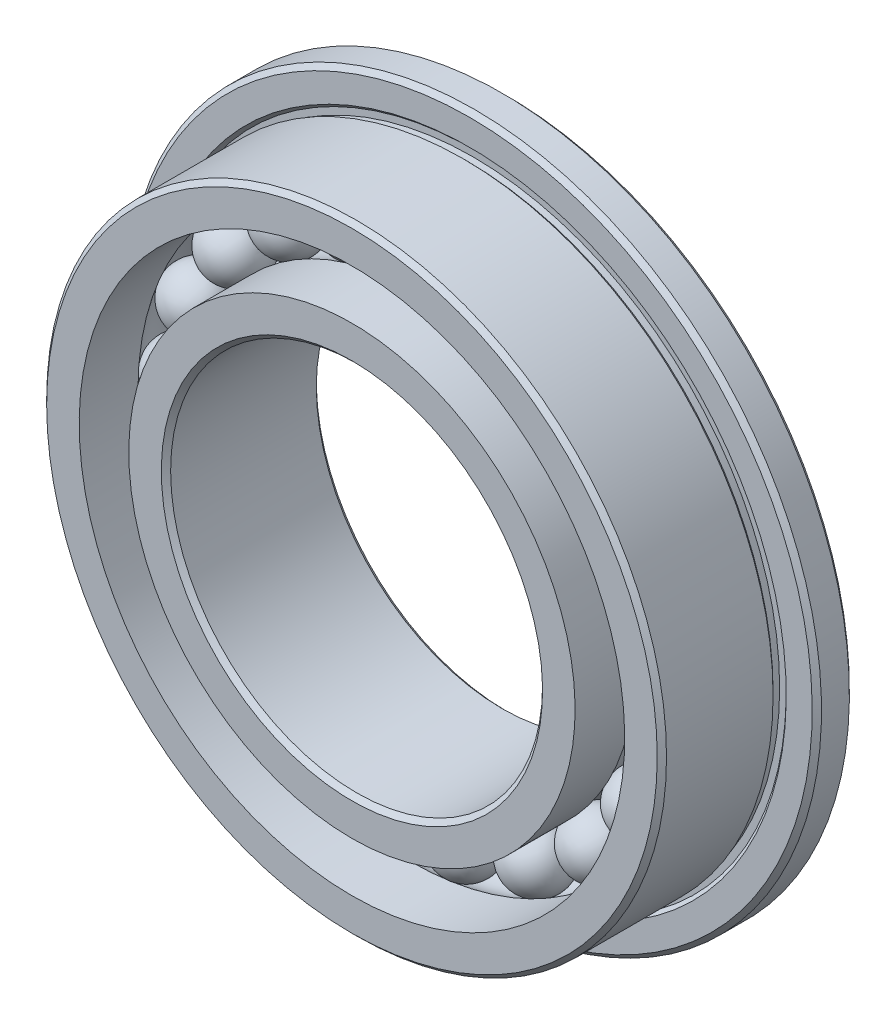
ISO-10303-21;
HEADER;
FILE_DESCRIPTION(('STEP AP214'),'2;1');
FILE_NAME('part.step','',(''),(''),'','','');
FILE_SCHEMA(('AUTOMOTIVE_DESIGN { 1 0 10303 214 1 1 1 1 }'));
ENDSEC;
DATA;
#1=APPLICATION_CONTEXT('core data for automotive mechanical design processes');
#2=APPLICATION_PROTOCOL_DEFINITION('international standard','automotive_design',2000,#1);
#3=PRODUCT_CONTEXT('',#1,'mechanical');
#4=PRODUCT('Part','Part','',(#3));
#5=PRODUCT_RELATED_PRODUCT_CATEGORY('part','',(#4));
#6=PRODUCT_DEFINITION_FORMATION('','',#4);
#7=PRODUCT_DEFINITION_CONTEXT('part definition',#1,'design');
#8=PRODUCT_DEFINITION('design','',#6,#7);
#9=PRODUCT_DEFINITION_SHAPE('','',#8);
#10=(LENGTH_UNIT() NAMED_UNIT(*) SI_UNIT(.MILLI.,.METRE.));
#11=(NAMED_UNIT(*) PLANE_ANGLE_UNIT() SI_UNIT($,.RADIAN.));
#12=(NAMED_UNIT(*) SI_UNIT($,.STERADIAN.) SOLID_ANGLE_UNIT());
#13=UNCERTAINTY_MEASURE_WITH_UNIT(LENGTH_MEASURE(1.E-05),#10,'distance_accuracy_value','');
#14=(GEOMETRIC_REPRESENTATION_CONTEXT(3) GLOBAL_UNCERTAINTY_ASSIGNED_CONTEXT((#13)) GLOBAL_UNIT_ASSIGNED_CONTEXT((#10,
#11,#12)) REPRESENTATION_CONTEXT('',''));
#15=CARTESIAN_POINT('',(0.,0.,0.));
#16=DIRECTION('',(0.,0.,1.));
#17=DIRECTION('',(1.,0.,0.));
#18=AXIS2_PLACEMENT_3D('',#15,#16,#17);
#19=CARTESIAN_POINT('',(-1.17902069764356,3.82229122314458,0.));
#20=DIRECTION('',(-0.294755174410891,0.955572805786145,0.));
#21=DIRECTION('',(0.955572805786145,0.294755174410891,0.));
#22=AXIS2_PLACEMENT_3D('',#19,#20,#21);
#23=SPHERICAL_SURFACE('',#22,0.5);
#24=CARTESIAN_POINT('',(-1.32639828484901,4.30007762603765,0.));
#25=VERTEX_POINT('',#24);
#26=VERTEX_LOOP('',#25);
#27=FACE_BOUND('',#26,.T.);
#28=ADVANCED_FACE('F41',(#27),#23,.T.);
#29=CLOSED_SHELL('',(#28));
#30=MANIFOLD_SOLID_BREP('B2',#29);
#31=CARTESIAN_POINT('',(-2.25328023225445,3.30495509726401,0.));
#32=DIRECTION('',(-0.563320058063612,0.826238774316002,0.));
#33=DIRECTION('',(0.826238774316002,0.563320058063612,0.));
#34=AXIS2_PLACEMENT_3D('',#31,#32,#33);
#35=SPHERICAL_SURFACE('',#34,0.5);
#36=CARTESIAN_POINT('',(-2.53494026128625,3.71807448442201,0.));
#37=VERTEX_POINT('',#36);
#38=VERTEX_LOOP('',#37);
#39=FACE_BOUND('',#38,.T.);
#40=ADVANCED_FACE('F61',(#39),#35,.T.);
#41=CLOSED_SHELL('',(#40));
#42=MANIFOLD_SOLID_BREP('B7',#41);
#43=CARTESIAN_POINT('',(-3.12732592987209,2.49395920743497,0.));
#44=DIRECTION('',(-0.781831482468022,0.623489801858743,0.));
#45=DIRECTION('',(0.623489801858743,0.781831482468022,0.));
#46=AXIS2_PLACEMENT_3D('',#43,#44,#45);
#47=SPHERICAL_SURFACE('',#46,0.5);
#48=CARTESIAN_POINT('',(-3.5182416711061,2.80570410836434,0.));
#49=VERTEX_POINT('',#48);
#50=VERTEX_LOOP('',#49);
#51=FACE_BOUND('',#50,.T.);
#52=ADVANCED_FACE('F81',(#51),#47,.T.);
#53=CLOSED_SHELL('',(#52));
#54=MANIFOLD_SOLID_BREP('B37',#53);
#55=CARTESIAN_POINT('',(-3.7234949945768,1.46136409746562,0.));
#56=DIRECTION('',(-0.9308737486442,0.365341024366405,0.));
#57=DIRECTION('',(0.365341024366405,0.9308737486442,0.));
#58=AXIS2_PLACEMENT_3D('',#55,#56,#57);
#59=SPHERICAL_SURFACE('',#58,0.5);
#60=CARTESIAN_POINT('',(-4.1889318688989,1.64403460964882,0.));
#61=VERTEX_POINT('',#60);
#62=VERTEX_LOOP('',#61);
#63=FACE_BOUND('',#62,.T.);
#64=ADVANCED_FACE('F101',(#63),#59,.T.);
#65=CLOSED_SHELL('',(#64));
#66=MANIFOLD_SOLID_BREP('B57',#65);
#67=CARTESIAN_POINT('',(-3.98881518872472,0.29892037434574,0.));
#68=DIRECTION('',(-0.997203797181179,0.0747300935864348,0.));
#69=DIRECTION('',(0.0747300935864348,0.997203797181179,0.));
#70=AXIS2_PLACEMENT_3D('',#67,#68,#69);
#71=SPHERICAL_SURFACE('',#70,0.5);
#72=CARTESIAN_POINT('',(-4.48741708731531,0.336285421138957,0.));
#73=VERTEX_POINT('',#72);
#74=VERTEX_LOOP('',#73);
#75=FACE_BOUND('',#74,.T.);
#76=ADVANCED_FACE('F121',(#75),#71,.T.);
#77=CLOSED_SHELL('',(#76));
#78=MANIFOLD_SOLID_BREP('B77',#77);
#79=CARTESIAN_POINT('',(-3.8997116487273,-0.890083735825217,0.));
#80=DIRECTION('',(-0.974927912181826,-0.222520933956304,0.));
#81=DIRECTION('',(-0.222520933956304,0.974927912181826,0.));
#82=AXIS2_PLACEMENT_3D('',#79,#80,#81);
#83=SPHERICAL_SURFACE('',#82,0.5);
#84=CARTESIAN_POINT('',(-4.38717560481822,-1.00134420280337,0.));
#85=VERTEX_POINT('',#84);
#86=VERTEX_LOOP('',#85);
#87=FACE_BOUND('',#86,.T.);
#88=ADVANCED_FACE('F141',(#87),#83,.T.);
#89=CLOSED_SHELL('',(#88));
#90=MANIFOLD_SOLID_BREP('B97',#89);
#91=CARTESIAN_POINT('',(-3.46410161513777,-1.99999999999997,0.));
#92=DIRECTION('',(-0.866025403784443,-0.499999999999992,0.));
#93=DIRECTION('',(-0.499999999999992,0.866025403784443,0.));
#94=AXIS2_PLACEMENT_3D('',#91,#92,#93);
#95=SPHERICAL_SURFACE('',#94,0.5);
#96=CARTESIAN_POINT('',(-3.89711431702999,-2.24999999999996,0.));
#97=VERTEX_POINT('',#96);
#98=VERTEX_LOOP('',#97);
#99=FACE_BOUND('',#98,.T.);
#100=ADVANCED_FACE('F161',(#99),#95,.T.);
#101=CLOSED_SHELL('',(#100));
#102=MANIFOLD_SOLID_BREP('B117',#101);
#103=CARTESIAN_POINT('',(-2.7206909510837,-2.93220748731928,0.));
#104=DIRECTION('',(-0.680172737770926,-0.733051871829821,0.));
#105=DIRECTION('',(-0.733051871829821,0.680172737770926,0.));
#106=AXIS2_PLACEMENT_3D('',#103,#104,#105);
#107=SPHERICAL_SURFACE('',#106,0.5);
#108=CARTESIAN_POINT('',(-3.06077731996917,-3.29873342323419,0.));
#109=VERTEX_POINT('',#108);
#110=VERTEX_LOOP('',#109);
#111=FACE_BOUND('',#110,.T.);
#112=ADVANCED_FACE('F181',(#111),#107,.T.);
#113=CLOSED_SHELL('',(#112));
#114=MANIFOLD_SOLID_BREP('B137',#113);
#115=CARTESIAN_POINT('',(-1.73553495647026,-3.60387547160966,0.));
#116=DIRECTION('',(-0.433883739117565,-0.900968867902416,0.));
#117=DIRECTION('',(-0.900968867902416,0.433883739117565,0.));
#118=AXIS2_PLACEMENT_3D('',#115,#116,#117);
#119=SPHERICAL_SURFACE('',#118,0.5);
#120=CARTESIAN_POINT('',(-1.95247682602904,-4.05435990556087,0.));
#121=VERTEX_POINT('',#120);
#122=VERTEX_LOOP('',#121);
#123=FACE_BOUND('',#122,.T.);
#124=ADVANCED_FACE('F201',(#123),#119,.T.);
#125=CLOSED_SHELL('',(#124));
#126=MANIFOLD_SOLID_BREP('B157',#125);
#127=CARTESIAN_POINT('',(-0.596169064704728,-3.95532330490051,0.));
#128=DIRECTION('',(-0.149042266176182,-0.988830826225127,0.));
#129=DIRECTION('',(-0.988830826225127,0.149042266176182,0.));
#130=AXIS2_PLACEMENT_3D('',#127,#128,#129);
#131=SPHERICAL_SURFACE('',#130,0.5);
#132=CARTESIAN_POINT('',(-0.670690197792819,-4.44973871801307,0.));
#133=VERTEX_POINT('',#132);
#134=VERTEX_LOOP('',#133);
#135=FACE_BOUND('',#134,.T.);
#136=ADVANCED_FACE('F221',(#135),#131,.T.);
#137=CLOSED_SHELL('',(#136));
#138=MANIFOLD_SOLID_BREP('B177',#137);
#139=CARTESIAN_POINT('',(0.596169064704671,-3.95532330490052,0.));
#140=DIRECTION('',(0.149042266176168,-0.98883082622513,0.));
#141=DIRECTION('',(-0.98883082622513,-0.149042266176168,0.));
#142=AXIS2_PLACEMENT_3D('',#139,#140,#141);
#143=SPHERICAL_SURFACE('',#142,0.5);
#144=CARTESIAN_POINT('',(0.670690197792755,-4.44973871801308,0.));
#145=VERTEX_POINT('',#144);
#146=VERTEX_LOOP('',#145);
#147=FACE_BOUND('',#146,.T.);
#148=ADVANCED_FACE('F241',(#147),#143,.T.);
#149=CLOSED_SHELL('',(#148));
#150=MANIFOLD_SOLID_BREP('B197',#149);
#151=CARTESIAN_POINT('',(1.73553495647021,-3.60387547160969,0.));
#152=DIRECTION('',(0.433883739117553,-0.900968867902422,0.));
#153=DIRECTION('',(-0.900968867902422,-0.433883739117553,0.));
#154=AXIS2_PLACEMENT_3D('',#151,#152,#153);
#155=SPHERICAL_SURFACE('',#154,0.5);
#156=CARTESIAN_POINT('',(1.95247682602899,-4.0543599055609,0.));
#157=VERTEX_POINT('',#156);
#158=VERTEX_LOOP('',#157);
#159=FACE_BOUND('',#158,.T.);
#160=ADVANCED_FACE('F261',(#159),#155,.T.);
#161=CLOSED_SHELL('',(#160));
#162=MANIFOLD_SOLID_BREP('B217',#161);
#163=CARTESIAN_POINT('',(2.72069095108366,-2.93220748731932,0.));
#164=DIRECTION('',(0.680172737770916,-0.73305187182983,0.));
#165=DIRECTION('',(-0.73305187182983,-0.680172737770916,0.));
#166=AXIS2_PLACEMENT_3D('',#163,#164,#165);
#167=SPHERICAL_SURFACE('',#166,0.5);
#168=CARTESIAN_POINT('',(3.06077731996912,-3.29873342323423,0.));
#169=VERTEX_POINT('',#168);
#170=VERTEX_LOOP('',#169);
#171=FACE_BOUND('',#170,.T.);
#172=ADVANCED_FACE('F281',(#171),#167,.T.);
#173=CLOSED_SHELL('',(#172));
#174=MANIFOLD_SOLID_BREP('B237',#173);
#175=CARTESIAN_POINT('',(3.46410161513775,-2.00000000000002,0.));
#176=DIRECTION('',(0.866025403784437,-0.500000000000004,0.));
#177=DIRECTION('',(-0.500000000000004,-0.866025403784437,0.));
#178=AXIS2_PLACEMENT_3D('',#175,#176,#177);
#179=SPHERICAL_SURFACE('',#178,0.5);
#180=CARTESIAN_POINT('',(3.89711431702996,-2.25000000000002,0.));
#181=VERTEX_POINT('',#180);
#182=VERTEX_LOOP('',#181);
#183=FACE_BOUND('',#182,.T.);
#184=ADVANCED_FACE('F301',(#183),#179,.T.);
#185=CLOSED_SHELL('',(#184));
#186=MANIFOLD_SOLID_BREP('B257',#185);
#187=CARTESIAN_POINT('',(3.89971164872729,-0.890083735825273,0.));
#188=DIRECTION('',(0.974927912181823,-0.222520933956318,0.));
#189=DIRECTION('',(-0.222520933956318,-0.974927912181823,0.));
#190=AXIS2_PLACEMENT_3D('',#187,#188,#189);
#191=SPHERICAL_SURFACE('',#190,0.5);
#192=CARTESIAN_POINT('',(4.3871756048182,-1.00134420280343,0.));
#193=VERTEX_POINT('',#192);
#194=VERTEX_LOOP('',#193);
#195=FACE_BOUND('',#194,.T.);
#196=ADVANCED_FACE('F321',(#195),#191,.T.);
#197=CLOSED_SHELL('',(#196));
#198=MANIFOLD_SOLID_BREP('B277',#197);
#199=CARTESIAN_POINT('',(3.98881518872472,0.298920374345683,0.));
#200=DIRECTION('',(0.997203797181181,0.074730093586421,0.));
#201=DIRECTION('',(0.074730093586421,-0.997203797181181,0.));
#202=AXIS2_PLACEMENT_3D('',#199,#200,#201);
#203=SPHERICAL_SURFACE('',#202,0.5);
#204=CARTESIAN_POINT('',(4.48741708731531,0.336285421138894,0.));
#205=VERTEX_POINT('',#204);
#206=VERTEX_LOOP('',#205);
#207=FACE_BOUND('',#206,.T.);
#208=ADVANCED_FACE('F341',(#207),#203,.T.);
#209=CLOSED_SHELL('',(#208));
#210=MANIFOLD_SOLID_BREP('B297',#209);
#211=CARTESIAN_POINT('',(3.72349499457682,1.46136409746557,0.));
#212=DIRECTION('',(0.930873748644205,0.365341024366393,0.));
#213=DIRECTION('',(0.365341024366393,-0.930873748644205,0.));
#214=AXIS2_PLACEMENT_3D('',#211,#212,#213);
#215=SPHERICAL_SURFACE('',#214,0.5);
#216=CARTESIAN_POINT('',(4.18893186889892,1.64403460964877,0.));
#217=VERTEX_POINT('',#216);
#218=VERTEX_LOOP('',#217);
#219=FACE_BOUND('',#218,.T.);
#220=ADVANCED_FACE('F361',(#219),#215,.T.);
#221=CLOSED_SHELL('',(#220));
#222=MANIFOLD_SOLID_BREP('B317',#221);
#223=CARTESIAN_POINT('',(3.12732592987212,2.49395920743493,0.));
#224=DIRECTION('',(0.781831482468031,0.623489801858732,0.));
#225=DIRECTION('',(0.623489801858732,-0.781831482468031,0.));
#226=AXIS2_PLACEMENT_3D('',#223,#224,#225);
#227=SPHERICAL_SURFACE('',#226,0.5);
#228=CARTESIAN_POINT('',(3.51824167110614,2.80570410836429,0.));
#229=VERTEX_POINT('',#228);
#230=VERTEX_LOOP('',#229);
#231=FACE_BOUND('',#230,.T.);
#232=ADVANCED_FACE('F381',(#231),#227,.T.);
#233=CLOSED_SHELL('',(#232));
#234=MANIFOLD_SOLID_BREP('B337',#233);
#235=CARTESIAN_POINT('',(2.25328023225449,3.30495509726398,0.));
#236=DIRECTION('',(0.563320058063623,0.826238774315994,0.));
#237=DIRECTION('',(0.826238774315994,-0.563320058063623,0.));
#238=AXIS2_PLACEMENT_3D('',#235,#236,#237);
#239=SPHERICAL_SURFACE('',#238,0.5);
#240=CARTESIAN_POINT('',(2.5349402612863,3.71807448442197,0.));
#241=VERTEX_POINT('',#240);
#242=VERTEX_LOOP('',#241);
#243=FACE_BOUND('',#242,.T.);
#244=ADVANCED_FACE('F401',(#243),#239,.T.);
#245=CLOSED_SHELL('',(#244));
#246=MANIFOLD_SOLID_BREP('B357',#245);
#247=CARTESIAN_POINT('',(1.17902069764362,3.82229122314456,0.));
#248=DIRECTION('',(0.294755174410905,0.955572805786141,0.));
#249=DIRECTION('',(0.955572805786141,-0.294755174410905,0.));
#250=AXIS2_PLACEMENT_3D('',#247,#248,#249);
#251=SPHERICAL_SURFACE('',#250,0.5);
#252=CARTESIAN_POINT('',(1.32639828484907,4.30007762603763,0.));
#253=VERTEX_POINT('',#252);
#254=VERTEX_LOOP('',#253);
#255=FACE_BOUND('',#254,.T.);
#256=ADVANCED_FACE('F421',(#255),#251,.T.);
#257=CLOSED_SHELL('',(#256));
#258=MANIFOLD_SOLID_BREP('B377',#257);
#259=CARTESIAN_POINT('',(0.,4.,0.));
#260=DIRECTION('',(0.,1.,0.));
#261=DIRECTION('',(1.,0.,0.));
#262=AXIS2_PLACEMENT_3D('',#259,#260,#261);
#263=SPHERICAL_SURFACE('',#262,0.5);
#264=CARTESIAN_POINT('',(0.,4.5,0.));
#265=VERTEX_POINT('',#264);
#266=VERTEX_LOOP('',#265);
#267=FACE_BOUND('',#266,.T.);
#268=ADVANCED_FACE('F444',(#267),#263,.T.);
#269=CLOSED_SHELL('',(#268));
#270=MANIFOLD_SOLID_BREP('B397',#269);
#271=CARTESIAN_POINT('',(0.,0.,0.));
#272=DIRECTION('',(0.,0.,1.));
#273=DIRECTION('',(0.,-1.,0.));
#274=AXIS2_PLACEMENT_3D('',#271,#272,#273);
#275=CYLINDRICAL_SURFACE('',#274,3.6);
#276=CARTESIAN_POINT('',(0.,0.,-0.3));
#277=DIRECTION('',(0.,0.,1.));
#278=DIRECTION('',(0.,-1.,0.));
#279=AXIS2_PLACEMENT_3D('',#276,#277,#278);
#280=CIRCLE('',#279,3.6);
#281=CARTESIAN_POINT('',(0.,-3.6,-0.3));
#282=VERTEX_POINT('',#281);
#283=EDGE_CURVE('E485',#282,#282,#280,.T.);
#284=ORIENTED_EDGE('',*,*,#283,.F.);
#285=EDGE_LOOP('',(#284));
#286=FACE_BOUND('',#285,.T.);
#287=CARTESIAN_POINT('',(0.,0.,-1.25));
#288=DIRECTION('',(0.,0.,1.));
#289=DIRECTION('',(0.,-1.,0.));
#290=AXIS2_PLACEMENT_3D('',#287,#288,#289);
#291=CIRCLE('',#290,3.6);
#292=CARTESIAN_POINT('',(0.,-3.6,-1.25));
#293=VERTEX_POINT('',#292);
#294=EDGE_CURVE('E494',#293,#293,#291,.T.);
#295=ORIENTED_EDGE('',*,*,#294,.T.);
#296=EDGE_LOOP('',(#295));
#297=FACE_BOUND('',#296,.T.);
#298=ADVANCED_FACE('F465',(#286,#297),#275,.T.);
#299=CARTESIAN_POINT('',(0.,0.,0.));
#300=DIRECTION('',(0.,0.,1.));
#301=DIRECTION('',(0.,-1.,0.));
#302=AXIS2_PLACEMENT_3D('',#299,#300,#301);
#303=TOROIDAL_SURFACE('',#302,4.,0.5);
#304=CARTESIAN_POINT('',(0.,0.,0.3));
#305=DIRECTION('',(0.,0.,1.));
#306=DIRECTION('',(0.,-1.,0.));
#307=AXIS2_PLACEMENT_3D('',#304,#305,#306);
#308=CIRCLE('',#307,3.6);
#309=CARTESIAN_POINT('',(0.,-3.6,0.3));
#310=VERTEX_POINT('',#309);
#311=EDGE_CURVE('E488',#310,#310,#308,.T.);
#312=ORIENTED_EDGE('',*,*,#311,.F.);
#313=EDGE_LOOP('',(#312));
#314=FACE_BOUND('',#313,.T.);
#315=ORIENTED_EDGE('',*,*,#283,.T.);
#316=EDGE_LOOP('',(#315));
#317=FACE_BOUND('',#316,.T.);
#318=ADVANCED_FACE('F513',(#314,#317),#303,.F.);
#319=CARTESIAN_POINT('',(0.,0.,0.));
#320=DIRECTION('',(0.,0.,1.));
#321=DIRECTION('',(0.,-1.,0.));
#322=AXIS2_PLACEMENT_3D('',#319,#320,#321);
#323=CYLINDRICAL_SURFACE('',#322,3.6);
#324=CARTESIAN_POINT('',(0.,0.,1.25));
#325=DIRECTION('',(0.,0.,1.));
#326=DIRECTION('',(0.,-1.,0.));
#327=AXIS2_PLACEMENT_3D('',#324,#325,#326);
#328=CIRCLE('',#327,3.6);
#329=CARTESIAN_POINT('',(0.,-3.6,1.25));
#330=VERTEX_POINT('',#329);
#331=EDGE_CURVE('E491',#330,#330,#328,.T.);
#332=ORIENTED_EDGE('',*,*,#331,.F.);
#333=EDGE_LOOP('',(#332));
#334=FACE_BOUND('',#333,.T.);
#335=ORIENTED_EDGE('',*,*,#311,.T.);
#336=EDGE_LOOP('',(#335));
#337=FACE_BOUND('',#336,.T.);
#338=ADVANCED_FACE('F519',(#334,#337),#323,.T.);
#339=CARTESIAN_POINT('',(0.,3.,1.25));
#340=DIRECTION('',(0.,0.,-1.));
#341=DIRECTION('',(0.,1.,0.));
#342=AXIS2_PLACEMENT_3D('',#339,#340,#341);
#343=PLANE('',#342);
#344=CARTESIAN_POINT('',(0.,0.,1.25));
#345=DIRECTION('',(0.,0.,-1.));
#346=DIRECTION('',(0.,1.,0.));
#347=AXIS2_PLACEMENT_3D('',#344,#345,#346);
#348=CIRCLE('',#347,3.075);
#349=CARTESIAN_POINT('',(0.,3.075,1.25));
#350=VERTEX_POINT('',#349);
#351=EDGE_CURVE('E443',#350,#350,#348,.T.);
#352=ORIENTED_EDGE('',*,*,#351,.T.);
#353=EDGE_LOOP('',(#352));
#354=FACE_BOUND('',#353,.T.);
#355=ORIENTED_EDGE('',*,*,#331,.T.);
#356=EDGE_LOOP('',(#355));
#357=FACE_BOUND('',#356,.T.);
#358=ADVANCED_FACE('F510',(#354,#357),#343,.F.);
#359=CARTESIAN_POINT('',(0.,0.,0.));
#360=DIRECTION('',(0.,0.,1.));
#361=DIRECTION('',(0.,-1.,0.));
#362=AXIS2_PLACEMENT_3D('',#359,#360,#361);
#363=CYLINDRICAL_SURFACE('',#362,3.);
#364=CARTESIAN_POINT('',(0.,0.,-1.175));
#365=DIRECTION('',(0.,0.,1.));
#366=DIRECTION('',(0.,-1.,0.));
#367=AXIS2_PLACEMENT_3D('',#364,#365,#366);
#368=CIRCLE('',#367,3.);
#369=CARTESIAN_POINT('',(0.,-3.,-1.175));
#370=VERTEX_POINT('',#369);
#371=EDGE_CURVE('E472',#370,#370,#368,.F.);
#372=ORIENTED_EDGE('',*,*,#371,.T.);
#373=EDGE_LOOP('',(#372));
#374=FACE_BOUND('',#373,.T.);
#375=CARTESIAN_POINT('',(0.,0.,1.175));
#376=DIRECTION('',(0.,0.,-1.));
#377=DIRECTION('',(0.,1.,0.));
#378=AXIS2_PLACEMENT_3D('',#375,#376,#377);
#379=CIRCLE('',#378,3.);
#380=CARTESIAN_POINT('',(0.,3.,1.175));
#381=VERTEX_POINT('',#380);
#382=EDGE_CURVE('E476',#381,#381,#379,.F.);
#383=ORIENTED_EDGE('',*,*,#382,.T.);
#384=EDGE_LOOP('',(#383));
#385=FACE_BOUND('',#384,.T.);
#386=ADVANCED_FACE('F502',(#374,#385),#363,.F.);
#387=CARTESIAN_POINT('',(0.,3.6,-1.25));
#388=DIRECTION('',(0.,0.,1.));
#389=DIRECTION('',(0.,-1.,0.));
#390=AXIS2_PLACEMENT_3D('',#387,#388,#389);
#391=PLANE('',#390);
#392=CARTESIAN_POINT('',(0.,0.,-1.25));
#393=DIRECTION('',(0.,0.,1.));
#394=DIRECTION('',(0.,-1.,0.));
#395=AXIS2_PLACEMENT_3D('',#392,#393,#394);
#396=CIRCLE('',#395,3.075);
#397=CARTESIAN_POINT('',(0.,-3.075,-1.25));
#398=VERTEX_POINT('',#397);
#399=EDGE_CURVE('E480',#398,#398,#396,.T.);
#400=ORIENTED_EDGE('',*,*,#399,.T.);
#401=EDGE_LOOP('',(#400));
#402=FACE_BOUND('',#401,.T.);
#403=ORIENTED_EDGE('',*,*,#294,.F.);
#404=EDGE_LOOP('',(#403));
#405=FACE_BOUND('',#404,.T.);
#406=ADVANCED_FACE('F499',(#402,#405),#391,.F.);
#407=CARTESIAN_POINT('',(0.,0.,-1.25));
#408=DIRECTION('',(0.,0.,-1.));
#409=DIRECTION('',(0.,1.,0.));
#410=AXIS2_PLACEMENT_3D('',#407,#408,#409);
#411=CONICAL_SURFACE('',#410,3.075,0.785398163397448);
#412=ORIENTED_EDGE('',*,*,#371,.F.);
#413=EDGE_LOOP('',(#412));
#414=FACE_BOUND('',#413,.T.);
#415=ORIENTED_EDGE('',*,*,#399,.F.);
#416=EDGE_LOOP('',(#415));
#417=FACE_BOUND('',#416,.T.);
#418=ADVANCED_FACE('F501',(#414,#417),#411,.F.);
#419=CARTESIAN_POINT('',(0.,0.,1.175));
#420=DIRECTION('',(0.,0.,1.));
#421=DIRECTION('',(0.,-1.,0.));
#422=AXIS2_PLACEMENT_3D('',#419,#420,#421);
#423=CONICAL_SURFACE('',#422,3.,0.785398163397448);
#424=ORIENTED_EDGE('',*,*,#351,.F.);
#425=EDGE_LOOP('',(#424));
#426=FACE_BOUND('',#425,.T.);
#427=ORIENTED_EDGE('',*,*,#382,.F.);
#428=EDGE_LOOP('',(#427));
#429=FACE_BOUND('',#428,.T.);
#430=ADVANCED_FACE('F467',(#426,#429),#423,.F.);
#431=CLOSED_SHELL('',(#298,#318,#338,#358,#386,#406,#418,#430));
#432=MANIFOLD_SOLID_BREP('B417',#431);
#433=CARTESIAN_POINT('',(0.,4.4,-1.25));
#434=DIRECTION('',(0.,0.,1.));
#435=DIRECTION('',(0.,-1.,0.));
#436=AXIS2_PLACEMENT_3D('',#433,#434,#435);
#437=PLANE('',#436);
#438=CARTESIAN_POINT('',(0.,0.,-1.25));
#439=DIRECTION('',(0.,0.,1.));
#440=DIRECTION('',(0.,-1.,0.));
#441=AXIS2_PLACEMENT_3D('',#438,#439,#440);
#442=CIRCLE('',#441,5.525);
#443=CARTESIAN_POINT('',(0.,-5.525,-1.25));
#444=VERTEX_POINT('',#443);
#445=EDGE_CURVE('E602',#444,#444,#442,.F.);
#446=ORIENTED_EDGE('',*,*,#445,.T.);
#447=EDGE_LOOP('',(#446));
#448=FACE_BOUND('',#447,.T.);
#449=CARTESIAN_POINT('',(0.,0.,-1.25));
#450=DIRECTION('',(0.,0.,1.));
#451=DIRECTION('',(0.,-1.,0.));
#452=AXIS2_PLACEMENT_3D('',#449,#450,#451);
#453=CIRCLE('',#452,4.4);
#454=CARTESIAN_POINT('',(0.,-4.4,-1.25));
#455=VERTEX_POINT('',#454);
#456=EDGE_CURVE('E613',#455,#455,#453,.T.);
#457=ORIENTED_EDGE('',*,*,#456,.T.);
#458=EDGE_LOOP('',(#457));
#459=FACE_BOUND('',#458,.T.);
#460=ADVANCED_FACE('F587',(#448,#459),#437,.F.);
#461=CARTESIAN_POINT('',(0.,0.,0.));
#462=DIRECTION('',(0.,0.,1.));
#463=DIRECTION('',(0.,-1.,0.));
#464=AXIS2_PLACEMENT_3D('',#461,#462,#463);
#465=CYLINDRICAL_SURFACE('',#464,4.4);
#466=ORIENTED_EDGE('',*,*,#456,.F.);
#467=EDGE_LOOP('',(#466));
#468=FACE_BOUND('',#467,.T.);
#469=CARTESIAN_POINT('',(0.,0.,-0.3));
#470=DIRECTION('',(0.,0.,1.));
#471=DIRECTION('',(0.,-1.,0.));
#472=AXIS2_PLACEMENT_3D('',#469,#470,#471);
#473=CIRCLE('',#472,4.4);
#474=CARTESIAN_POINT('',(0.,-4.4,-0.3));
#475=VERTEX_POINT('',#474);
#476=EDGE_CURVE('E616',#475,#475,#473,.T.);
#477=ORIENTED_EDGE('',*,*,#476,.T.);
#478=EDGE_LOOP('',(#477));
#479=FACE_BOUND('',#478,.T.);
#480=ADVANCED_FACE('F659',(#468,#479),#465,.F.);
#481=CARTESIAN_POINT('',(0.,0.,0.));
#482=DIRECTION('',(0.,0.,1.));
#483=DIRECTION('',(0.,-1.,0.));
#484=AXIS2_PLACEMENT_3D('',#481,#482,#483);
#485=TOROIDAL_SURFACE('',#484,4.,0.5);
#486=ORIENTED_EDGE('',*,*,#476,.F.);
#487=EDGE_LOOP('',(#486));
#488=FACE_BOUND('',#487,.T.);
#489=CARTESIAN_POINT('',(0.,0.,0.3));
#490=DIRECTION('',(0.,0.,1.));
#491=DIRECTION('',(0.,-1.,0.));
#492=AXIS2_PLACEMENT_3D('',#489,#490,#491);
#493=CIRCLE('',#492,4.4);
#494=CARTESIAN_POINT('',(0.,-4.4,0.3));
#495=VERTEX_POINT('',#494);
#496=EDGE_CURVE('E619',#495,#495,#493,.T.);
#497=ORIENTED_EDGE('',*,*,#496,.T.);
#498=EDGE_LOOP('',(#497));
#499=FACE_BOUND('',#498,.T.);
#500=ADVANCED_FACE('F665',(#488,#499),#485,.F.);
#501=CARTESIAN_POINT('',(0.,0.,0.));
#502=DIRECTION('',(0.,0.,1.));
#503=DIRECTION('',(0.,-1.,0.));
#504=AXIS2_PLACEMENT_3D('',#501,#502,#503);
#505=CYLINDRICAL_SURFACE('',#504,4.4);
#506=ORIENTED_EDGE('',*,*,#496,.F.);
#507=EDGE_LOOP('',(#506));
#508=FACE_BOUND('',#507,.T.);
#509=CARTESIAN_POINT('',(0.,0.,1.25));
#510=DIRECTION('',(0.,0.,1.));
#511=DIRECTION('',(0.,-1.,0.));
#512=AXIS2_PLACEMENT_3D('',#509,#510,#511);
#513=CIRCLE('',#512,4.4);
#514=CARTESIAN_POINT('',(0.,-4.4,1.25));
#515=VERTEX_POINT('',#514);
#516=EDGE_CURVE('E622',#515,#515,#513,.T.);
#517=ORIENTED_EDGE('',*,*,#516,.T.);
#518=EDGE_LOOP('',(#517));
#519=FACE_BOUND('',#518,.T.);
#520=ADVANCED_FACE('F729',(#508,#519),#505,.F.);
#521=CARTESIAN_POINT('',(0.,5.,1.25));
#522=DIRECTION('',(0.,0.,-1.));
#523=DIRECTION('',(0.,1.,0.));
#524=AXIS2_PLACEMENT_3D('',#521,#522,#523);
#525=PLANE('',#524);
#526=CARTESIAN_POINT('',(0.,0.,1.25));
#527=DIRECTION('',(0.,0.,-1.));
#528=DIRECTION('',(0.,1.,0.));
#529=AXIS2_PLACEMENT_3D('',#526,#527,#528);
#530=CIRCLE('',#529,4.925);
#531=CARTESIAN_POINT('',(0.,4.925,1.25));
#532=VERTEX_POINT('',#531);
#533=EDGE_CURVE('E594',#532,#532,#530,.F.);
#534=ORIENTED_EDGE('',*,*,#533,.T.);
#535=EDGE_LOOP('',(#534));
#536=FACE_BOUND('',#535,.T.);
#537=ORIENTED_EDGE('',*,*,#516,.F.);
#538=EDGE_LOOP('',(#537));
#539=FACE_BOUND('',#538,.T.);
#540=ADVANCED_FACE('F719',(#536,#539),#525,.F.);
#541=CARTESIAN_POINT('',(0.,0.,0.));
#542=DIRECTION('',(0.,0.,1.));
#543=DIRECTION('',(0.,-1.,0.));
#544=AXIS2_PLACEMENT_3D('',#541,#542,#543);
#545=CYLINDRICAL_SURFACE('',#544,5.);
#546=CARTESIAN_POINT('',(0.,0.,1.175));
#547=DIRECTION('',(0.,0.,-1.));
#548=DIRECTION('',(0.,1.,0.));
#549=AXIS2_PLACEMENT_3D('',#546,#547,#548);
#550=CIRCLE('',#549,5.);
#551=CARTESIAN_POINT('',(0.,5.,1.175));
#552=VERTEX_POINT('',#551);
#553=EDGE_CURVE('E464',#552,#552,#550,.T.);
#554=ORIENTED_EDGE('',*,*,#553,.T.);
#555=EDGE_LOOP('',(#554));
#556=FACE_BOUND('',#555,.T.);
#557=CARTESIAN_POINT('',(0.,0.,-0.543933982822015));
#558=DIRECTION('',(0.,0.,1.));
#559=DIRECTION('',(0.,-1.,0.));
#560=AXIS2_PLACEMENT_3D('',#557,#558,#559);
#561=CIRCLE('',#560,5.);
#562=CARTESIAN_POINT('',(0.,-5.,-0.543933982822015));
#563=VERTEX_POINT('',#562);
#564=EDGE_CURVE('E625',#563,#563,#561,.T.);
#565=ORIENTED_EDGE('',*,*,#564,.T.);
#566=EDGE_LOOP('',(#565));
#567=FACE_BOUND('',#566,.T.);
#568=ADVANCED_FACE('F713',(#556,#567),#545,.T.);
#569=CARTESIAN_POINT('',(0.,0.,-0.59696699141101));
#570=DIRECTION('',(0.,0.,1.));
#571=DIRECTION('',(0.,-1.,0.));
#572=AXIS2_PLACEMENT_3D('',#569,#570,#571);
#573=CONICAL_SURFACE('',#572,4.94696699141101,0.785398163397435);
#574=ORIENTED_EDGE('',*,*,#564,.F.);
#575=EDGE_LOOP('',(#574));
#576=FACE_BOUND('',#575,.T.);
#577=CARTESIAN_POINT('',(0.,0.,-0.59696699141101));
#578=DIRECTION('',(0.,0.,1.));
#579=DIRECTION('',(0.,-1.,0.));
#580=AXIS2_PLACEMENT_3D('',#577,#578,#579);
#581=CIRCLE('',#580,4.94696699141101);
#582=CARTESIAN_POINT('',(0.,-4.94696699141101,-0.59696699141101));
#583=VERTEX_POINT('',#582);
#584=EDGE_CURVE('E628',#583,#583,#581,.T.);
#585=ORIENTED_EDGE('',*,*,#584,.T.);
#586=EDGE_LOOP('',(#585));
#587=FACE_BOUND('',#586,.T.);
#588=ADVANCED_FACE('F718',(#576,#587),#573,.T.);
#589=CARTESIAN_POINT('',(0.,0.,0.));
#590=DIRECTION('',(0.,0.,1.));
#591=DIRECTION('',(0.,-1.,0.));
#592=AXIS2_PLACEMENT_3D('',#589,#590,#591);
#593=CYLINDRICAL_SURFACE('',#592,4.94696699141101);
#594=ORIENTED_EDGE('',*,*,#584,.F.);
#595=EDGE_LOOP('',(#594));
#596=FACE_BOUND('',#595,.T.);
#597=CARTESIAN_POINT('',(0.,0.,-0.703033008588993));
#598=DIRECTION('',(0.,0.,1.));
#599=DIRECTION('',(0.,-1.,0.));
#600=AXIS2_PLACEMENT_3D('',#597,#598,#599);
#601=CIRCLE('',#600,4.94696699141101);
#602=CARTESIAN_POINT('',(0.,-4.94696699141101,-0.703033008588993));
#603=VERTEX_POINT('',#602);
#604=EDGE_CURVE('E631',#603,#603,#601,.T.);
#605=ORIENTED_EDGE('',*,*,#604,.T.);
#606=EDGE_LOOP('',(#605));
#607=FACE_BOUND('',#606,.T.);
#608=ADVANCED_FACE('F751',(#596,#607),#593,.T.);
#609=CARTESIAN_POINT('',(0.,5.05303300858899,-0.703033008588992));
#610=DIRECTION('',(0.,0.,-1.));
#611=DIRECTION('',(0.,1.,0.));
#612=AXIS2_PLACEMENT_3D('',#609,#610,#611);
#613=PLANE('',#612);
#614=ORIENTED_EDGE('',*,*,#604,.F.);
#615=EDGE_LOOP('',(#614));
#616=FACE_BOUND('',#615,.T.);
#617=CARTESIAN_POINT('',(0.,0.,-0.703033008588992));
#618=DIRECTION('',(0.,0.,1.));
#619=DIRECTION('',(0.,-1.,0.));
#620=AXIS2_PLACEMENT_3D('',#617,#618,#619);
#621=CIRCLE('',#620,5.05303300858899);
#622=CARTESIAN_POINT('',(0.,-5.05303300858899,-0.703033008588992));
#623=VERTEX_POINT('',#622);
#624=EDGE_CURVE('E634',#623,#623,#621,.T.);
#625=ORIENTED_EDGE('',*,*,#624,.T.);
#626=EDGE_LOOP('',(#625));
#627=FACE_BOUND('',#626,.T.);
#628=ADVANCED_FACE('F655',(#616,#627),#613,.F.);
#629=CARTESIAN_POINT('',(0.,0.,-0.650000000000001));
#630=DIRECTION('',(0.,0.,1.));
#631=DIRECTION('',(0.,-1.,0.));
#632=AXIS2_PLACEMENT_3D('',#629,#630,#631);
#633=CONICAL_SURFACE('',#632,5.10606601717798,0.785398163397436);
#634=ORIENTED_EDGE('',*,*,#624,.F.);
#635=EDGE_LOOP('',(#634));
#636=FACE_BOUND('',#635,.T.);
#637=CARTESIAN_POINT('',(0.,0.,-0.650000000000001));
#638=DIRECTION('',(0.,0.,1.));
#639=DIRECTION('',(0.,-1.,0.));
#640=AXIS2_PLACEMENT_3D('',#637,#638,#639);
#641=CIRCLE('',#640,5.10606601717798);
#642=CARTESIAN_POINT('',(0.,-5.10606601717798,-0.650000000000001));
#643=VERTEX_POINT('',#642);
#644=EDGE_CURVE('E637',#643,#643,#641,.T.);
#645=ORIENTED_EDGE('',*,*,#644,.T.);
#646=EDGE_LOOP('',(#645));
#647=FACE_BOUND('',#646,.T.);
#648=ADVANCED_FACE('F641',(#636,#647),#633,.F.);
#649=CARTESIAN_POINT('',(0.,5.6,-0.650000000000001));
#650=DIRECTION('',(0.,0.,-1.));
#651=DIRECTION('',(0.,1.,0.));
#652=AXIS2_PLACEMENT_3D('',#649,#650,#651);
#653=PLANE('',#652);
#654=CARTESIAN_POINT('',(0.,0.,-0.650000000000001));
#655=DIRECTION('',(0.,0.,-1.));
#656=DIRECTION('',(0.,1.,0.));
#657=AXIS2_PLACEMENT_3D('',#654,#655,#656);
#658=CIRCLE('',#657,5.525);
#659=CARTESIAN_POINT('',(0.,5.525,-0.650000000000001));
#660=VERTEX_POINT('',#659);
#661=EDGE_CURVE('E598',#660,#660,#658,.F.);
#662=ORIENTED_EDGE('',*,*,#661,.T.);
#663=EDGE_LOOP('',(#662));
#664=FACE_BOUND('',#663,.T.);
#665=ORIENTED_EDGE('',*,*,#644,.F.);
#666=EDGE_LOOP('',(#665));
#667=FACE_BOUND('',#666,.T.);
#668=ADVANCED_FACE('F643',(#664,#667),#653,.F.);
#669=CARTESIAN_POINT('',(0.,0.,0.));
#670=DIRECTION('',(0.,0.,1.));
#671=DIRECTION('',(0.,-1.,0.));
#672=AXIS2_PLACEMENT_3D('',#669,#670,#671);
#673=CYLINDRICAL_SURFACE('',#672,5.6);
#674=CARTESIAN_POINT('',(0.,0.,-1.175));
#675=DIRECTION('',(0.,0.,1.));
#676=DIRECTION('',(0.,-1.,0.));
#677=AXIS2_PLACEMENT_3D('',#674,#675,#676);
#678=CIRCLE('',#677,5.6);
#679=CARTESIAN_POINT('',(0.,-5.6,-1.175));
#680=VERTEX_POINT('',#679);
#681=EDGE_CURVE('E607',#680,#680,#678,.T.);
#682=ORIENTED_EDGE('',*,*,#681,.T.);
#683=EDGE_LOOP('',(#682));
#684=FACE_BOUND('',#683,.T.);
#685=CARTESIAN_POINT('',(0.,0.,-0.725000000000001));
#686=DIRECTION('',(0.,0.,-1.));
#687=DIRECTION('',(0.,1.,0.));
#688=AXIS2_PLACEMENT_3D('',#685,#686,#687);
#689=CIRCLE('',#688,5.6);
#690=CARTESIAN_POINT('',(0.,5.6,-0.725000000000001));
#691=VERTEX_POINT('',#690);
#692=EDGE_CURVE('E610',#691,#691,#689,.T.);
#693=ORIENTED_EDGE('',*,*,#692,.T.);
#694=EDGE_LOOP('',(#693));
#695=FACE_BOUND('',#694,.T.);
#696=ADVANCED_FACE('F645',(#684,#695),#673,.T.);
#697=CARTESIAN_POINT('',(0.,0.,-1.175));
#698=DIRECTION('',(0.,0.,1.));
#699=DIRECTION('',(0.,-1.,0.));
#700=AXIS2_PLACEMENT_3D('',#697,#698,#699);
#701=CONICAL_SURFACE('',#700,5.6,0.785398163397451);
#702=ORIENTED_EDGE('',*,*,#445,.F.);
#703=EDGE_LOOP('',(#702));
#704=FACE_BOUND('',#703,.T.);
#705=ORIENTED_EDGE('',*,*,#681,.F.);
#706=EDGE_LOOP('',(#705));
#707=FACE_BOUND('',#706,.T.);
#708=ADVANCED_FACE('F652',(#704,#707),#701,.T.);
#709=CARTESIAN_POINT('',(0.,0.,-0.650000000000001));
#710=DIRECTION('',(0.,0.,-1.));
#711=DIRECTION('',(0.,1.,0.));
#712=AXIS2_PLACEMENT_3D('',#709,#710,#711);
#713=CONICAL_SURFACE('',#712,5.525,0.785398163397451);
#714=ORIENTED_EDGE('',*,*,#692,.F.);
#715=EDGE_LOOP('',(#714));
#716=FACE_BOUND('',#715,.T.);
#717=ORIENTED_EDGE('',*,*,#661,.F.);
#718=EDGE_LOOP('',(#717));
#719=FACE_BOUND('',#718,.T.);
#720=ADVANCED_FACE('F672',(#716,#719),#713,.T.);
#721=CARTESIAN_POINT('',(0.,0.,1.25));
#722=DIRECTION('',(0.,0.,-1.));
#723=DIRECTION('',(0.,1.,0.));
#724=AXIS2_PLACEMENT_3D('',#721,#722,#723);
#725=CONICAL_SURFACE('',#724,4.925,0.785398163397451);
#726=ORIENTED_EDGE('',*,*,#553,.F.);
#727=EDGE_LOOP('',(#726));
#728=FACE_BOUND('',#727,.T.);
#729=ORIENTED_EDGE('',*,*,#533,.F.);
#730=EDGE_LOOP('',(#729));
#731=FACE_BOUND('',#730,.T.);
#732=ADVANCED_FACE('F589',(#728,#731),#725,.T.);
#733=CLOSED_SHELL('',(#460,#480,#500,#520,#540,#568,#588,#608,#628,#648,#668,#696,#708,#720,#732));
#734=MANIFOLD_SOLID_BREP('B438',#733);
#735=ADVANCED_BREP_SHAPE_REPRESENTATION('',(#18,#30,#42,#54,#66,#78,#90,#102,#114,#126,#138,
#150,#162,#174,#186,#198,#210,#222,#234,#246,#258,#270,#432,#734),#14);
#736=SHAPE_DEFINITION_REPRESENTATION(#9,#735);
ENDSEC;
END-ISO-10303-21;
